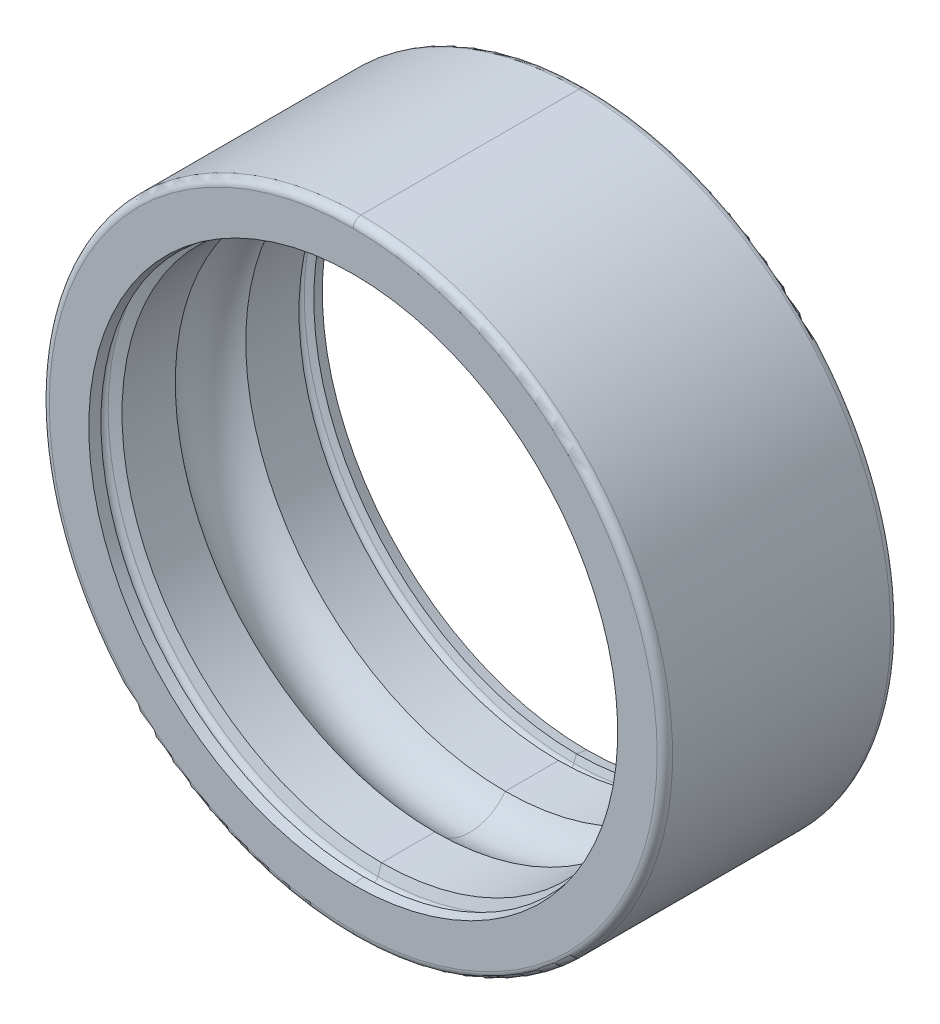
ISO-10303-21;
HEADER;
FILE_DESCRIPTION(('STEP AP214'),'2;1');
FILE_NAME('part.step','',(''),(''),'','','');
FILE_SCHEMA(('AUTOMOTIVE_DESIGN { 1 0 10303 214 1 1 1 1 }'));
ENDSEC;
DATA;
#1=APPLICATION_CONTEXT('core data for automotive mechanical design processes');
#2=APPLICATION_PROTOCOL_DEFINITION('international standard','automotive_design',2000,#1);
#3=PRODUCT_CONTEXT('',#1,'mechanical');
#4=PRODUCT('Part','Part','',(#3));
#5=PRODUCT_RELATED_PRODUCT_CATEGORY('part','',(#4));
#6=PRODUCT_DEFINITION_FORMATION('','',#4);
#7=PRODUCT_DEFINITION_CONTEXT('part definition',#1,'design');
#8=PRODUCT_DEFINITION('design','',#6,#7);
#9=PRODUCT_DEFINITION_SHAPE('','',#8);
#10=(LENGTH_UNIT() NAMED_UNIT(*) SI_UNIT(.MILLI.,.METRE.));
#11=(NAMED_UNIT(*) PLANE_ANGLE_UNIT() SI_UNIT($,.RADIAN.));
#12=(NAMED_UNIT(*) SI_UNIT($,.STERADIAN.) SOLID_ANGLE_UNIT());
#13=UNCERTAINTY_MEASURE_WITH_UNIT(LENGTH_MEASURE(1.E-05),#10,'distance_accuracy_value','');
#14=(GEOMETRIC_REPRESENTATION_CONTEXT(3) GLOBAL_UNCERTAINTY_ASSIGNED_CONTEXT((#13)) GLOBAL_UNIT_ASSIGNED_CONTEXT((#10,
#11,#12)) REPRESENTATION_CONTEXT('',''));
#15=CARTESIAN_POINT('',(0.,0.,0.));
#16=DIRECTION('',(0.,0.,1.));
#17=DIRECTION('',(1.,0.,0.));
#18=AXIS2_PLACEMENT_3D('',#15,#16,#17);
#19=CARTESIAN_POINT('',(0.,0.,-1.37117133981801));
#20=DIRECTION('',(0.,0.,1.));
#21=DIRECTION('',(0.,1.,0.));
#22=AXIS2_PLACEMENT_3D('',#19,#20,#21);
#23=CONICAL_SURFACE('',#22,3.35814874954358,1.22173047639603);
#24=DIRECTION('',(0.,-0.939692620785909,-0.342020143325669));
#25=VECTOR('',#24,1.);
#26=CARTESIAN_POINT('',(0.,3.46094982970443,-1.33375480658905));
#27=LINE('',#26,#25);
#28=CARTESIAN_POINT('',(0.,3.4609498297044,-1.33375480658897));
#29=VERTEX_POINT('',#28);
#30=CARTESIAN_POINT('',(0.,3.37134806634323,-1.36636718139026));
#31=VERTEX_POINT('',#30);
#32=EDGE_CURVE('E22',#29,#31,#27,.T.);
#33=ORIENTED_EDGE('',*,*,#32,.F.);
#34=CARTESIAN_POINT('',(0.,0.,-1.3337548065889));
#35=DIRECTION('',(0.,0.,1.));
#36=DIRECTION('',(0.,1.,0.));
#37=AXIS2_PLACEMENT_3D('',#34,#35,#36);
#38=CIRCLE('',#37,3.46094982970437);
#39=CARTESIAN_POINT('',(0.,-3.4609498297044,-1.33375480658897));
#40=VERTEX_POINT('',#39);
#41=EDGE_CURVE('E414',#29,#40,#38,.T.);
#42=ORIENTED_EDGE('',*,*,#41,.T.);
#43=DIRECTION('',(0.,0.939692620785909,-0.342020143325669));
#44=VECTOR('',#43,1.);
#45=CARTESIAN_POINT('',(0.,-3.46094982970443,-1.33375480658905));
#46=LINE('',#45,#44);
#47=CARTESIAN_POINT('',(0.,-3.37134806634323,-1.36636718139026));
#48=VERTEX_POINT('',#47);
#49=EDGE_CURVE('E418',#40,#48,#46,.T.);
#50=ORIENTED_EDGE('',*,*,#49,.T.);
#51=CARTESIAN_POINT('',(0.,0.,-1.36636718139037));
#52=DIRECTION('',(0.,0.,1.));
#53=DIRECTION('',(0.,1.,0.));
#54=AXIS2_PLACEMENT_3D('',#51,#52,#53);
#55=CIRCLE('',#54,3.37134806634301);
#56=EDGE_CURVE('E288',#31,#48,#55,.T.);
#57=ORIENTED_EDGE('',*,*,#56,.F.);
#58=EDGE_LOOP('',(#33,#42,#50,#57));
#59=FACE_BOUND('',#58,.T.);
#60=ADVANCED_FACE('F19',(#59),#23,.F.);
#61=CARTESIAN_POINT('',(0.,0.,1.64846));
#62=DIRECTION('',(0.,0.,-1.));
#63=DIRECTION('',(0.,-1.,0.));
#64=AXIS2_PLACEMENT_3D('',#61,#62,#63);
#65=CYLINDRICAL_SURFACE('',#64,4.0005);
#66=CARTESIAN_POINT('',(0.,0.,1.39954));
#67=DIRECTION('',(0.,0.,-1.));
#68=DIRECTION('',(0.,1.,0.));
#69=AXIS2_PLACEMENT_3D('',#66,#67,#68);
#70=CIRCLE('',#69,4.0005);
#71=CARTESIAN_POINT('',(0.,4.0005,1.39954));
#72=VERTEX_POINT('',#71);
#73=CARTESIAN_POINT('',(0.,-4.0005,1.39954));
#74=VERTEX_POINT('',#73);
#75=EDGE_CURVE('E167',#72,#74,#70,.T.);
#76=ORIENTED_EDGE('',*,*,#75,.T.);
#77=DIRECTION('',(0.,0.,-1.));
#78=VECTOR('',#77,1.);
#79=CARTESIAN_POINT('',(0.,-4.0005,1.39954));
#80=LINE('',#79,#78);
#81=CARTESIAN_POINT('',(0.,-4.0005,-1.39954));
#82=VERTEX_POINT('',#81);
#83=EDGE_CURVE('E12',#74,#82,#80,.T.);
#84=ORIENTED_EDGE('',*,*,#83,.T.);
#85=CARTESIAN_POINT('',(0.,0.,-1.39954));
#86=DIRECTION('',(0.,0.,1.));
#87=DIRECTION('',(0.,-1.,0.));
#88=AXIS2_PLACEMENT_3D('',#85,#86,#87);
#89=CIRCLE('',#88,4.0005);
#90=CARTESIAN_POINT('',(0.,4.0005,-1.39954));
#91=VERTEX_POINT('',#90);
#92=EDGE_CURVE('E39',#82,#91,#89,.T.);
#93=ORIENTED_EDGE('',*,*,#92,.T.);
#94=DIRECTION('',(0.,0.,-1.));
#95=VECTOR('',#94,1.);
#96=CARTESIAN_POINT('',(0.,4.0005,1.39954));
#97=LINE('',#96,#95);
#98=EDGE_CURVE('E28',#72,#91,#97,.T.);
#99=ORIENTED_EDGE('',*,*,#98,.F.);
#100=EDGE_LOOP('',(#76,#84,#93,#99));
#101=FACE_BOUND('',#100,.T.);
#102=ADVANCED_FACE('F405',(#101),#65,.T.);
#103=CARTESIAN_POINT('',(0.,0.,1.64846));
#104=DIRECTION('',(0.,0.,-1.));
#105=DIRECTION('',(0.,-1.,0.));
#106=AXIS2_PLACEMENT_3D('',#103,#104,#105);
#107=CYLINDRICAL_SURFACE('',#106,4.0005);
#108=CARTESIAN_POINT('',(0.,0.,-1.39954));
#109=DIRECTION('',(0.,0.,1.));
#110=DIRECTION('',(0.,1.,0.));
#111=AXIS2_PLACEMENT_3D('',#108,#109,#110);
#112=CIRCLE('',#111,4.0005);
#113=EDGE_CURVE('E181',#91,#82,#112,.T.);
#114=ORIENTED_EDGE('',*,*,#113,.T.);
#115=ORIENTED_EDGE('',*,*,#83,.F.);
#116=CARTESIAN_POINT('',(0.,0.,1.39954));
#117=DIRECTION('',(0.,0.,-1.));
#118=DIRECTION('',(0.,-1.,0.));
#119=AXIS2_PLACEMENT_3D('',#116,#117,#118);
#120=CIRCLE('',#119,4.0005);
#121=EDGE_CURVE('E164',#74,#72,#120,.T.);
#122=ORIENTED_EDGE('',*,*,#121,.T.);
#123=ORIENTED_EDGE('',*,*,#98,.T.);
#124=EDGE_LOOP('',(#114,#115,#122,#123));
#125=FACE_BOUND('',#124,.T.);
#126=ADVANCED_FACE('F410',(#125),#107,.T.);
#127=CARTESIAN_POINT('',(0.,0.,-1.39954));
#128=DIRECTION('',(0.,0.,-1.));
#129=DIRECTION('',(0.,-1.,0.));
#130=AXIS2_PLACEMENT_3D('',#127,#128,#129);
#131=TOROIDAL_SURFACE('',#130,3.90144,0.09906);
#132=CARTESIAN_POINT('',(0.,0.,-1.4986));
#133=DIRECTION('',(0.,0.,1.));
#134=DIRECTION('',(0.,1.,0.));
#135=AXIS2_PLACEMENT_3D('',#132,#133,#134);
#136=CIRCLE('',#135,3.90144);
#137=CARTESIAN_POINT('',(0.,3.90144,-1.4986));
#138=VERTEX_POINT('',#137);
#139=CARTESIAN_POINT('',(0.,-3.90144,-1.4986));
#140=VERTEX_POINT('',#139);
#141=EDGE_CURVE('E298',#138,#140,#136,.T.);
#142=ORIENTED_EDGE('',*,*,#141,.T.);
#143=CARTESIAN_POINT('',(0.,-3.90144,-1.39954));
#144=DIRECTION('',(1.,0.,0.));
#145=DIRECTION('',(0.,-1.,0.));
#146=AXIS2_PLACEMENT_3D('',#143,#144,#145);
#147=CIRCLE('',#146,0.09906);
#148=EDGE_CURVE('E187',#82,#140,#147,.T.);
#149=ORIENTED_EDGE('',*,*,#148,.F.);
#150=ORIENTED_EDGE('',*,*,#113,.F.);
#151=CARTESIAN_POINT('',(0.,3.90144,-1.39954));
#152=DIRECTION('',(-1.,0.,0.));
#153=DIRECTION('',(0.,1.,0.));
#154=AXIS2_PLACEMENT_3D('',#151,#152,#153);
#155=CIRCLE('',#154,0.09906);
#156=EDGE_CURVE('E190',#91,#138,#155,.T.);
#157=ORIENTED_EDGE('',*,*,#156,.T.);
#158=EDGE_LOOP('',(#142,#149,#150,#157));
#159=FACE_BOUND('',#158,.T.);
#160=ADVANCED_FACE('F567',(#159),#131,.T.);
#161=CARTESIAN_POINT('',(0.,0.,-1.39954));
#162=DIRECTION('',(0.,0.,-1.));
#163=DIRECTION('',(0.,-1.,0.));
#164=AXIS2_PLACEMENT_3D('',#161,#162,#163);
#165=TOROIDAL_SURFACE('',#164,3.90144,0.09906);
#166=ORIENTED_EDGE('',*,*,#92,.F.);
#167=ORIENTED_EDGE('',*,*,#148,.T.);
#168=CARTESIAN_POINT('',(0.,0.,-1.4986));
#169=DIRECTION('',(0.,0.,1.));
#170=DIRECTION('',(0.,-1.,0.));
#171=AXIS2_PLACEMENT_3D('',#168,#169,#170);
#172=CIRCLE('',#171,3.90144);
#173=EDGE_CURVE('E291',#140,#138,#172,.T.);
#174=ORIENTED_EDGE('',*,*,#173,.T.);
#175=ORIENTED_EDGE('',*,*,#156,.F.);
#176=EDGE_LOOP('',(#166,#167,#174,#175));
#177=FACE_BOUND('',#176,.T.);
#178=ADVANCED_FACE('F563',(#177),#165,.T.);
#179=CARTESIAN_POINT('',(0.,0.,-1.4986));
#180=DIRECTION('',(0.,0.,-1.));
#181=DIRECTION('',(0.,-1.,0.));
#182=AXIS2_PLACEMENT_3D('',#179,#180,#181);
#183=PLANE('',#182);
#184=CARTESIAN_POINT('',(0.,0.,-1.4986000000001));
#185=DIRECTION('',(0.,0.,-1.));
#186=DIRECTION('',(0.,1.,0.));
#187=AXIS2_PLACEMENT_3D('',#184,#185,#186);
#188=CIRCLE('',#187,3.39466427999951);
#189=CARTESIAN_POINT('',(0.,3.39466427999967,-1.49860000000006));
#190=VERTEX_POINT('',#189);
#191=CARTESIAN_POINT('',(0.,-3.39466427999967,-1.49860000000006));
#192=VERTEX_POINT('',#191);
#193=EDGE_CURVE('E301',#190,#192,#188,.T.);
#194=ORIENTED_EDGE('',*,*,#193,.F.);
#195=CARTESIAN_POINT('',(0.,0.,-1.4986000000001));
#196=DIRECTION('',(0.,0.,-1.));
#197=DIRECTION('',(0.,-1.,0.));
#198=AXIS2_PLACEMENT_3D('',#195,#196,#197);
#199=CIRCLE('',#198,3.39466427999951);
#200=EDGE_CURVE('E292',#192,#190,#199,.T.);
#201=ORIENTED_EDGE('',*,*,#200,.F.);
#202=EDGE_LOOP('',(#194,#201));
#203=FACE_BOUND('',#202,.T.);
#204=ORIENTED_EDGE('',*,*,#141,.F.);
#205=ORIENTED_EDGE('',*,*,#173,.F.);
#206=EDGE_LOOP('',(#204,#205));
#207=FACE_BOUND('',#206,.T.);
#208=ADVANCED_FACE('F560',(#203,#207),#183,.T.);
#209=CARTESIAN_POINT('',(0.,0.,-1.35253415851541));
#210=DIRECTION('',(0.,0.,-1.));
#211=DIRECTION('',(0.,-1.,0.));
#212=AXIS2_PLACEMENT_3D('',#209,#210,#211);
#213=CONICAL_SURFACE('',#212,3.36890893118588,0.174532925199433);
#214=ORIENTED_EDGE('',*,*,#56,.T.);
#215=DIRECTION('',(0.,0.173648177666929,0.984807753012208));
#216=VECTOR('',#215,1.);
#217=CARTESIAN_POINT('',(0.,-3.39466427999951,-1.49860000000009));
#218=LINE('',#217,#216);
#219=EDGE_CURVE('E305',#192,#48,#218,.T.);
#220=ORIENTED_EDGE('',*,*,#219,.F.);
#221=ORIENTED_EDGE('',*,*,#200,.T.);
#222=DIRECTION('',(0.,-0.173648177666929,0.984807753012208));
#223=VECTOR('',#222,1.);
#224=CARTESIAN_POINT('',(0.,3.39466427999951,-1.49860000000009));
#225=LINE('',#224,#223);
#226=EDGE_CURVE('E440',#190,#31,#225,.T.);
#227=ORIENTED_EDGE('',*,*,#226,.T.);
#228=EDGE_LOOP('',(#214,#220,#221,#227));
#229=FACE_BOUND('',#228,.T.);
#230=ADVANCED_FACE('F556',(#229),#213,.F.);
#231=CARTESIAN_POINT('',(0.,0.,-1.35253415851541));
#232=DIRECTION('',(0.,0.,-1.));
#233=DIRECTION('',(0.,-1.,0.));
#234=AXIS2_PLACEMENT_3D('',#231,#232,#233);
#235=CONICAL_SURFACE('',#234,3.36890893118588,0.174532925199433);
#236=ORIENTED_EDGE('',*,*,#193,.T.);
#237=ORIENTED_EDGE('',*,*,#219,.T.);
#238=CARTESIAN_POINT('',(0.,0.,-1.36636718139037));
#239=DIRECTION('',(0.,0.,1.));
#240=DIRECTION('',(0.,-1.,0.));
#241=AXIS2_PLACEMENT_3D('',#238,#239,#240);
#242=CIRCLE('',#241,3.37134806634301);
#243=EDGE_CURVE('E419',#48,#31,#242,.T.);
#244=ORIENTED_EDGE('',*,*,#243,.T.);
#245=ORIENTED_EDGE('',*,*,#226,.F.);
#246=EDGE_LOOP('',(#236,#237,#244,#245));
#247=FACE_BOUND('',#246,.T.);
#248=ADVANCED_FACE('F553',(#247),#235,.F.);
#249=CARTESIAN_POINT('',(0.,0.,-1.37117133981801));
#250=DIRECTION('',(0.,0.,1.));
#251=DIRECTION('',(0.,1.,0.));
#252=AXIS2_PLACEMENT_3D('',#249,#250,#251);
#253=CONICAL_SURFACE('',#252,3.35814874954358,1.22173047639603);
#254=ORIENTED_EDGE('',*,*,#49,.F.);
#255=CARTESIAN_POINT('',(0.,0.,-1.3337548065889));
#256=DIRECTION('',(0.,0.,1.));
#257=DIRECTION('',(0.,-1.,0.));
#258=AXIS2_PLACEMENT_3D('',#255,#256,#257);
#259=CIRCLE('',#258,3.46094982970437);
#260=EDGE_CURVE('E206',#40,#29,#259,.T.);
#261=ORIENTED_EDGE('',*,*,#260,.T.);
#262=ORIENTED_EDGE('',*,*,#32,.T.);
#263=ORIENTED_EDGE('',*,*,#243,.F.);
#264=EDGE_LOOP('',(#254,#261,#262,#263));
#265=FACE_BOUND('',#264,.T.);
#266=ADVANCED_FACE('F422',(#265),#253,.F.);
#267=CARTESIAN_POINT('',(0.,0.,-1.25857));
#268=DIRECTION('',(0.,0.,-1.));
#269=DIRECTION('',(0.,-1.,0.));
#270=AXIS2_PLACEMENT_3D('',#267,#268,#269);
#271=TOROIDAL_SURFACE('',#270,3.43358479803638,0.08001);
#272=ORIENTED_EDGE('',*,*,#260,.F.);
#273=CARTESIAN_POINT('',(0.,-3.43358479803638,-1.25857));
#274=DIRECTION('',(-1.,0.,0.));
#275=DIRECTION('',(0.,-0.342020143331979,-0.939692620783611));
#276=AXIS2_PLACEMENT_3D('',#273,#274,#275);
#277=CIRCLE('',#276,0.08001);
#278=CARTESIAN_POINT('',(0.,-3.51359479803638,-1.25857));
#279=VERTEX_POINT('',#278);
#280=EDGE_CURVE('E207',#40,#279,#277,.T.);
#281=ORIENTED_EDGE('',*,*,#280,.T.);
#282=CARTESIAN_POINT('',(0.,-3.43358479803638,-1.25857));
#283=DIRECTION('',(-1.,0.,0.));
#284=DIRECTION('',(0.,-1.,0.));
#285=AXIS2_PLACEMENT_3D('',#282,#283,#284);
#286=CIRCLE('',#285,0.08001);
#287=CARTESIAN_POINT('',(0.,-3.46094982970447,-1.18338519341083));
#288=VERTEX_POINT('',#287);
#289=EDGE_CURVE('E203',#279,#288,#286,.T.);
#290=ORIENTED_EDGE('',*,*,#289,.T.);
#291=CARTESIAN_POINT('',(0.,0.,-1.1833851934111));
#292=DIRECTION('',(0.,0.,-1.));
#293=DIRECTION('',(0.,1.,0.));
#294=AXIS2_PLACEMENT_3D('',#291,#292,#293);
#295=CIRCLE('',#294,3.46094982970437);
#296=CARTESIAN_POINT('',(0.,3.46094982970447,-1.18338519341083));
#297=VERTEX_POINT('',#296);
#298=EDGE_CURVE('E215',#297,#288,#295,.T.);
#299=ORIENTED_EDGE('',*,*,#298,.F.);
#300=CARTESIAN_POINT('',(0.,3.43358479803638,-1.25857));
#301=DIRECTION('',(1.,0.,0.));
#302=DIRECTION('',(0.,1.,0.));
#303=AXIS2_PLACEMENT_3D('',#300,#301,#302);
#304=CIRCLE('',#303,0.08001);
#305=CARTESIAN_POINT('',(0.,3.51359479803638,-1.25857));
#306=VERTEX_POINT('',#305);
#307=EDGE_CURVE('E214',#306,#297,#304,.T.);
#308=ORIENTED_EDGE('',*,*,#307,.F.);
#309=CARTESIAN_POINT('',(0.,3.43358479803638,-1.25857));
#310=DIRECTION('',(1.,0.,0.));
#311=DIRECTION('',(0.,0.342020143331979,-0.939692620783611));
#312=AXIS2_PLACEMENT_3D('',#309,#310,#311);
#313=CIRCLE('',#312,0.08001);
#314=EDGE_CURVE('E216',#29,#306,#313,.T.);
#315=ORIENTED_EDGE('',*,*,#314,.F.);
#316=EDGE_LOOP('',(#272,#281,#290,#299,#308,#315));
#317=FACE_BOUND('',#316,.T.);
#318=ADVANCED_FACE('F427',(#317),#271,.F.);
#319=CARTESIAN_POINT('',(0.,0.,-1.25857));
#320=DIRECTION('',(0.,0.,-1.));
#321=DIRECTION('',(0.,-1.,0.));
#322=AXIS2_PLACEMENT_3D('',#319,#320,#321);
#323=TOROIDAL_SURFACE('',#322,3.43358479803638,0.08001);
#324=CARTESIAN_POINT('',(0.,0.,-1.1833851934111));
#325=DIRECTION('',(0.,0.,-1.));
#326=DIRECTION('',(0.,-1.,0.));
#327=AXIS2_PLACEMENT_3D('',#324,#325,#326);
#328=CIRCLE('',#327,3.46094982970437);
#329=EDGE_CURVE('E210',#288,#297,#328,.T.);
#330=ORIENTED_EDGE('',*,*,#329,.F.);
#331=ORIENTED_EDGE('',*,*,#289,.F.);
#332=ORIENTED_EDGE('',*,*,#280,.F.);
#333=ORIENTED_EDGE('',*,*,#41,.F.);
#334=ORIENTED_EDGE('',*,*,#314,.T.);
#335=ORIENTED_EDGE('',*,*,#307,.T.);
#336=EDGE_LOOP('',(#330,#331,#332,#333,#334,#335));
#337=FACE_BOUND('',#336,.T.);
#338=ADVANCED_FACE('F431',(#337),#323,.F.);
#339=CARTESIAN_POINT('',(0.,0.,-1.13118340978411));
#340=DIRECTION('',(0.,0.,-1.));
#341=DIRECTION('',(0.,-1.,0.));
#342=AXIS2_PLACEMENT_3D('',#339,#340,#341);
#343=CONICAL_SURFACE('',#342,3.31752660793567,1.22173047639603);
#344=CARTESIAN_POINT('',(0.,0.,-1.13598756821175));
#345=DIRECTION('',(0.,0.,-1.));
#346=DIRECTION('',(0.,-1.,0.));
#347=AXIS2_PLACEMENT_3D('',#344,#345,#346);
#348=CIRCLE('',#347,3.3307259247351);
#349=CARTESIAN_POINT('',(0.,-3.33072592473504,-1.13598756821192));
#350=VERTEX_POINT('',#349);
#351=CARTESIAN_POINT('',(0.,3.33072592473504,-1.13598756821192));
#352=VERTEX_POINT('',#351);
#353=EDGE_CURVE('E434',#350,#352,#348,.T.);
#354=ORIENTED_EDGE('',*,*,#353,.F.);
#355=DIRECTION('',(0.,0.939692620785908,0.342020143325669));
#356=VECTOR('',#355,1.);
#357=CARTESIAN_POINT('',(0.,-3.46094982970457,-1.18338519341055));
#358=LINE('',#357,#356);
#359=EDGE_CURVE('E231',#288,#350,#358,.T.);
#360=ORIENTED_EDGE('',*,*,#359,.F.);
#361=ORIENTED_EDGE('',*,*,#329,.T.);
#362=DIRECTION('',(0.,-0.939692620785908,0.342020143325669));
#363=VECTOR('',#362,1.);
#364=CARTESIAN_POINT('',(0.,3.46094982970457,-1.18338519341055));
#365=LINE('',#364,#363);
#366=EDGE_CURVE('E227',#297,#352,#365,.T.);
#367=ORIENTED_EDGE('',*,*,#366,.T.);
#368=EDGE_LOOP('',(#354,#360,#361,#367));
#369=FACE_BOUND('',#368,.T.);
#370=ADVANCED_FACE('F454',(#369),#343,.F.);
#371=CARTESIAN_POINT('',(0.,0.,-1.13118340978411));
#372=DIRECTION('',(0.,0.,-1.));
#373=DIRECTION('',(0.,-1.,0.));
#374=AXIS2_PLACEMENT_3D('',#371,#372,#373);
#375=CONICAL_SURFACE('',#374,3.31752660793567,1.22173047639603);
#376=ORIENTED_EDGE('',*,*,#298,.T.);
#377=ORIENTED_EDGE('',*,*,#359,.T.);
#378=CARTESIAN_POINT('',(0.,0.,-1.13598756821175));
#379=DIRECTION('',(0.,0.,-1.));
#380=DIRECTION('',(0.,1.,0.));
#381=AXIS2_PLACEMENT_3D('',#378,#379,#380);
#382=CIRCLE('',#381,3.3307259247351);
#383=EDGE_CURVE('E236',#352,#350,#382,.T.);
#384=ORIENTED_EDGE('',*,*,#383,.F.);
#385=ORIENTED_EDGE('',*,*,#366,.F.);
#386=EDGE_LOOP('',(#376,#377,#384,#385));
#387=FACE_BOUND('',#386,.T.);
#388=ADVANCED_FACE('F458',(#387),#375,.F.);
#389=CARTESIAN_POINT('',(0.,0.,0.07493));
#390=DIRECTION('',(0.,0.,-1.));
#391=DIRECTION('',(0.,-1.,0.));
#392=AXIS2_PLACEMENT_3D('',#389,#390,#391);
#393=CYLINDRICAL_SURFACE('',#392,3.33072592473498);
#394=DIRECTION('',(0.,0.,-1.));
#395=VECTOR('',#394,1.);
#396=CARTESIAN_POINT('',(0.,-3.33072592473498,1.13598756821209));
#397=LINE('',#396,#395);
#398=CARTESIAN_POINT('',(0.,-3.33072592473504,1.13598756821192));
#399=VERTEX_POINT('',#398);
#400=CARTESIAN_POINT('',(0.,-3.33072592473505,0.452268362177334));
#401=VERTEX_POINT('',#400);
#402=EDGE_CURVE('E233',#399,#401,#397,.T.);
#403=ORIENTED_EDGE('',*,*,#402,.F.);
#404=CARTESIAN_POINT('',(0.,0.,1.13598756821175));
#405=DIRECTION('',(0.,0.,1.));
#406=DIRECTION('',(0.,-1.,0.));
#407=AXIS2_PLACEMENT_3D('',#404,#405,#406);
#408=CIRCLE('',#407,3.3307259247351);
#409=CARTESIAN_POINT('',(0.,3.33072592473504,1.13598756821192));
#410=VERTEX_POINT('',#409);
#411=EDGE_CURVE('E247',#399,#410,#408,.T.);
#412=ORIENTED_EDGE('',*,*,#411,.T.);
#413=DIRECTION('',(0.,0.,1.));
#414=VECTOR('',#413,1.);
#415=CARTESIAN_POINT('',(0.,3.33072592473498,0.45226836217724));
#416=LINE('',#415,#414);
#417=CARTESIAN_POINT('',(0.,3.33072592473505,0.452268362177334));
#418=VERTEX_POINT('',#417);
#419=EDGE_CURVE('E509',#418,#410,#416,.T.);
#420=ORIENTED_EDGE('',*,*,#419,.F.);
#421=CARTESIAN_POINT('',(0.,0.,0.452268362177428));
#422=DIRECTION('',(0.,0.,-1.));
#423=DIRECTION('',(0.,1.,0.));
#424=AXIS2_PLACEMENT_3D('',#421,#422,#423);
#425=CIRCLE('',#424,3.33072592473512);
#426=EDGE_CURVE('E232',#418,#401,#425,.T.);
#427=ORIENTED_EDGE('',*,*,#426,.T.);
#428=EDGE_LOOP('',(#403,#412,#420,#427));
#429=FACE_BOUND('',#428,.T.);
#430=ADVANCED_FACE('F518',(#429),#393,.F.);
#431=CARTESIAN_POINT('',(0.,0.,0.));
#432=DIRECTION('',(0.,0.,-1.));
#433=DIRECTION('',(0.,-1.,0.));
#434=AXIS2_PLACEMENT_3D('',#431,#432,#433);
#435=TOROIDAL_SURFACE('',#434,3.000375,0.56007);
#436=CARTESIAN_POINT('',(0.,-3.000375,0.));
#437=DIRECTION('',(1.,0.,0.));
#438=DIRECTION('',(0.,-1.,0.));
#439=AXIS2_PLACEMENT_3D('',#436,#437,#438);
#440=CIRCLE('',#439,0.56007);
#441=CARTESIAN_POINT('',(0.,-3.560445,0.));
#442=VERTEX_POINT('',#441);
#443=CARTESIAN_POINT('',(0.,-3.33072592473505,-0.452268362177334));
#444=VERTEX_POINT('',#443);
#445=EDGE_CURVE('E506',#442,#444,#440,.T.);
#446=ORIENTED_EDGE('',*,*,#445,.F.);
#447=CARTESIAN_POINT('',(0.,-3.000375,0.));
#448=DIRECTION('',(1.,0.,0.));
#449=DIRECTION('',(0.,-0.589838635768952,0.807521135174939));
#450=AXIS2_PLACEMENT_3D('',#447,#448,#449);
#451=CIRCLE('',#450,0.56007);
#452=EDGE_CURVE('E494',#401,#442,#451,.T.);
#453=ORIENTED_EDGE('',*,*,#452,.F.);
#454=ORIENTED_EDGE('',*,*,#426,.F.);
#455=CARTESIAN_POINT('',(0.,3.000375,0.));
#456=DIRECTION('',(-1.,0.,0.));
#457=DIRECTION('',(0.,0.589838635768952,0.807521135174938));
#458=AXIS2_PLACEMENT_3D('',#455,#456,#457);
#459=CIRCLE('',#458,0.56007);
#460=CARTESIAN_POINT('',(0.,3.560445,0.));
#461=VERTEX_POINT('',#460);
#462=EDGE_CURVE('E492',#418,#461,#459,.T.);
#463=ORIENTED_EDGE('',*,*,#462,.T.);
#464=CARTESIAN_POINT('',(0.,3.000375,0.));
#465=DIRECTION('',(-1.,0.,0.));
#466=DIRECTION('',(0.,1.,0.));
#467=AXIS2_PLACEMENT_3D('',#464,#465,#466);
#468=CIRCLE('',#467,0.56007);
#469=CARTESIAN_POINT('',(0.,3.33072592473505,-0.452268362177334));
#470=VERTEX_POINT('',#469);
#471=EDGE_CURVE('E471',#461,#470,#468,.T.);
#472=ORIENTED_EDGE('',*,*,#471,.T.);
#473=CARTESIAN_POINT('',(0.,0.,-0.452268362177428));
#474=DIRECTION('',(0.,0.,1.));
#475=DIRECTION('',(0.,-1.,0.));
#476=AXIS2_PLACEMENT_3D('',#473,#474,#475);
#477=CIRCLE('',#476,3.33072592473512);
#478=EDGE_CURVE('E239',#444,#470,#477,.T.);
#479=ORIENTED_EDGE('',*,*,#478,.F.);
#480=EDGE_LOOP('',(#446,#453,#454,#463,#472,#479));
#481=FACE_BOUND('',#480,.T.);
#482=ADVANCED_FACE('F523',(#481),#435,.F.);
#483=CARTESIAN_POINT('',(0.,0.,0.07493));
#484=DIRECTION('',(0.,0.,-1.));
#485=DIRECTION('',(0.,-1.,0.));
#486=AXIS2_PLACEMENT_3D('',#483,#484,#485);
#487=CYLINDRICAL_SURFACE('',#486,3.33072592473498);
#488=DIRECTION('',(0.,0.,1.));
#489=VECTOR('',#488,1.);
#490=CARTESIAN_POINT('',(0.,3.33072592473498,-1.13598756821209));
#491=LINE('',#490,#489);
#492=EDGE_CURVE('E465',#352,#470,#491,.T.);
#493=ORIENTED_EDGE('',*,*,#492,.F.);
#494=ORIENTED_EDGE('',*,*,#383,.T.);
#495=DIRECTION('',(0.,0.,-1.));
#496=VECTOR('',#495,1.);
#497=CARTESIAN_POINT('',(0.,-3.33072592473498,-0.45226836217724));
#498=LINE('',#497,#496);
#499=EDGE_CURVE('E474',#444,#350,#498,.T.);
#500=ORIENTED_EDGE('',*,*,#499,.F.);
#501=ORIENTED_EDGE('',*,*,#478,.T.);
#502=EDGE_LOOP('',(#493,#494,#500,#501));
#503=FACE_BOUND('',#502,.T.);
#504=ADVANCED_FACE('F467',(#503),#487,.F.);
#505=CARTESIAN_POINT('',(0.,0.,0.07493));
#506=DIRECTION('',(0.,0.,-1.));
#507=DIRECTION('',(0.,-1.,0.));
#508=AXIS2_PLACEMENT_3D('',#505,#506,#507);
#509=CYLINDRICAL_SURFACE('',#508,3.33072592473498);
#510=ORIENTED_EDGE('',*,*,#499,.T.);
#511=ORIENTED_EDGE('',*,*,#353,.T.);
#512=ORIENTED_EDGE('',*,*,#492,.T.);
#513=CARTESIAN_POINT('',(0.,0.,-0.452268362177428));
#514=DIRECTION('',(0.,0.,1.));
#515=DIRECTION('',(0.,1.,0.));
#516=AXIS2_PLACEMENT_3D('',#513,#514,#515);
#517=CIRCLE('',#516,3.33072592473512);
#518=EDGE_CURVE('E490',#470,#444,#517,.T.);
#519=ORIENTED_EDGE('',*,*,#518,.T.);
#520=EDGE_LOOP('',(#510,#511,#512,#519));
#521=FACE_BOUND('',#520,.T.);
#522=ADVANCED_FACE('F473',(#521),#509,.F.);
#523=CARTESIAN_POINT('',(0.,0.,0.));
#524=DIRECTION('',(0.,0.,-1.));
#525=DIRECTION('',(0.,-1.,0.));
#526=AXIS2_PLACEMENT_3D('',#523,#524,#525);
#527=TOROIDAL_SURFACE('',#526,3.000375,0.56007);
#528=ORIENTED_EDGE('',*,*,#471,.F.);
#529=ORIENTED_EDGE('',*,*,#462,.F.);
#530=CARTESIAN_POINT('',(0.,0.,0.452268362177428));
#531=DIRECTION('',(0.,0.,-1.));
#532=DIRECTION('',(0.,-1.,0.));
#533=AXIS2_PLACEMENT_3D('',#530,#531,#532);
#534=CIRCLE('',#533,3.33072592473512);
#535=EDGE_CURVE('E487',#401,#418,#534,.T.);
#536=ORIENTED_EDGE('',*,*,#535,.F.);
#537=ORIENTED_EDGE('',*,*,#452,.T.);
#538=ORIENTED_EDGE('',*,*,#445,.T.);
#539=ORIENTED_EDGE('',*,*,#518,.F.);
#540=EDGE_LOOP('',(#528,#529,#536,#537,#538,#539));
#541=FACE_BOUND('',#540,.T.);
#542=ADVANCED_FACE('F526',(#541),#527,.F.);
#543=CARTESIAN_POINT('',(0.,0.,0.07493));
#544=DIRECTION('',(0.,0.,-1.));
#545=DIRECTION('',(0.,-1.,0.));
#546=AXIS2_PLACEMENT_3D('',#543,#544,#545);
#547=CYLINDRICAL_SURFACE('',#546,3.33072592473498);
#548=ORIENTED_EDGE('',*,*,#419,.T.);
#549=CARTESIAN_POINT('',(0.,0.,1.13598756821175));
#550=DIRECTION('',(0.,0.,1.));
#551=DIRECTION('',(0.,1.,0.));
#552=AXIS2_PLACEMENT_3D('',#549,#550,#551);
#553=CIRCLE('',#552,3.3307259247351);
#554=EDGE_CURVE('E251',#410,#399,#553,.T.);
#555=ORIENTED_EDGE('',*,*,#554,.T.);
#556=ORIENTED_EDGE('',*,*,#402,.T.);
#557=ORIENTED_EDGE('',*,*,#535,.T.);
#558=EDGE_LOOP('',(#548,#555,#556,#557));
#559=FACE_BOUND('',#558,.T.);
#560=ADVANCED_FACE('F515',(#559),#547,.F.);
#561=CARTESIAN_POINT('',(0.,0.,1.13118340978411));
#562=DIRECTION('',(0.,0.,1.));
#563=DIRECTION('',(0.,1.,0.));
#564=AXIS2_PLACEMENT_3D('',#561,#562,#563);
#565=CONICAL_SURFACE('',#564,3.31752660793567,1.22173047639603);
#566=CARTESIAN_POINT('',(0.,0.,1.1833851934111));
#567=DIRECTION('',(0.,0.,1.));
#568=DIRECTION('',(0.,1.,0.));
#569=AXIS2_PLACEMENT_3D('',#566,#567,#568);
#570=CIRCLE('',#569,3.46094982970437);
#571=CARTESIAN_POINT('',(0.,3.46094982970447,1.18338519341083));
#572=VERTEX_POINT('',#571);
#573=CARTESIAN_POINT('',(0.,-3.46094982970447,1.18338519341083));
#574=VERTEX_POINT('',#573);
#575=EDGE_CURVE('E277',#572,#574,#570,.T.);
#576=ORIENTED_EDGE('',*,*,#575,.T.);
#577=DIRECTION('',(0.,0.939692620785908,-0.342020143325669));
#578=VECTOR('',#577,1.);
#579=CARTESIAN_POINT('',(0.,-3.46094982970457,1.18338519341055));
#580=LINE('',#579,#578);
#581=EDGE_CURVE('E252',#574,#399,#580,.T.);
#582=ORIENTED_EDGE('',*,*,#581,.T.);
#583=ORIENTED_EDGE('',*,*,#554,.F.);
#584=DIRECTION('',(0.,-0.939692620785908,-0.342020143325669));
#585=VECTOR('',#584,1.);
#586=CARTESIAN_POINT('',(0.,3.46094982970457,1.18338519341055));
#587=LINE('',#586,#585);
#588=EDGE_CURVE('E255',#572,#410,#587,.T.);
#589=ORIENTED_EDGE('',*,*,#588,.F.);
#590=EDGE_LOOP('',(#576,#582,#583,#589));
#591=FACE_BOUND('',#590,.T.);
#592=ADVANCED_FACE('F368',(#591),#565,.F.);
#593=CARTESIAN_POINT('',(0.,0.,1.13118340978411));
#594=DIRECTION('',(0.,0.,1.));
#595=DIRECTION('',(0.,1.,0.));
#596=AXIS2_PLACEMENT_3D('',#593,#594,#595);
#597=CONICAL_SURFACE('',#596,3.31752660793567,1.22173047639603);
#598=ORIENTED_EDGE('',*,*,#411,.F.);
#599=ORIENTED_EDGE('',*,*,#581,.F.);
#600=CARTESIAN_POINT('',(0.,0.,1.1833851934111));
#601=DIRECTION('',(0.,0.,1.));
#602=DIRECTION('',(0.,-1.,0.));
#603=AXIS2_PLACEMENT_3D('',#600,#601,#602);
#604=CIRCLE('',#603,3.46094982970437);
#605=EDGE_CURVE('E259',#574,#572,#604,.T.);
#606=ORIENTED_EDGE('',*,*,#605,.T.);
#607=ORIENTED_EDGE('',*,*,#588,.T.);
#608=EDGE_LOOP('',(#598,#599,#606,#607));
#609=FACE_BOUND('',#608,.T.);
#610=ADVANCED_FACE('F373',(#609),#597,.F.);
#611=CARTESIAN_POINT('',(0.,0.,1.25857));
#612=DIRECTION('',(0.,0.,-1.));
#613=DIRECTION('',(0.,-1.,0.));
#614=AXIS2_PLACEMENT_3D('',#611,#612,#613);
#615=TOROIDAL_SURFACE('',#614,3.43358479803638,0.08001);
#616=ORIENTED_EDGE('',*,*,#605,.F.);
#617=CARTESIAN_POINT('',(0.,-3.43358479803638,1.25857));
#618=DIRECTION('',(1.,0.,0.));
#619=DIRECTION('',(0.,-1.,0.));
#620=AXIS2_PLACEMENT_3D('',#617,#618,#619);
#621=CIRCLE('',#620,0.08001);
#622=CARTESIAN_POINT('',(0.,-3.51359479803638,1.25857));
#623=VERTEX_POINT('',#622);
#624=EDGE_CURVE('E273',#623,#574,#621,.T.);
#625=ORIENTED_EDGE('',*,*,#624,.F.);
#626=CARTESIAN_POINT('',(0.,-3.43358479803638,1.25857));
#627=DIRECTION('',(1.,0.,0.));
#628=DIRECTION('',(0.,-0.342020143331979,0.939692620783611));
#629=AXIS2_PLACEMENT_3D('',#626,#627,#628);
#630=CIRCLE('',#629,0.08001);
#631=CARTESIAN_POINT('',(0.,-3.4609498297044,1.33375480658897));
#632=VERTEX_POINT('',#631);
#633=EDGE_CURVE('E272',#632,#623,#630,.T.);
#634=ORIENTED_EDGE('',*,*,#633,.F.);
#635=CARTESIAN_POINT('',(0.,0.,1.3337548065889));
#636=DIRECTION('',(0.,0.,-1.));
#637=DIRECTION('',(0.,1.,0.));
#638=AXIS2_PLACEMENT_3D('',#635,#636,#637);
#639=CIRCLE('',#638,3.46094982970437);
#640=CARTESIAN_POINT('',(0.,3.4609498297044,1.33375480658897));
#641=VERTEX_POINT('',#640);
#642=EDGE_CURVE('E334',#641,#632,#639,.T.);
#643=ORIENTED_EDGE('',*,*,#642,.F.);
#644=CARTESIAN_POINT('',(0.,3.43358479803638,1.25857));
#645=DIRECTION('',(-1.,0.,0.));
#646=DIRECTION('',(0.,0.342020143331979,0.939692620783611));
#647=AXIS2_PLACEMENT_3D('',#644,#645,#646);
#648=CIRCLE('',#647,0.08001);
#649=CARTESIAN_POINT('',(0.,3.51359479803638,1.25857));
#650=VERTEX_POINT('',#649);
#651=EDGE_CURVE('E344',#641,#650,#648,.T.);
#652=ORIENTED_EDGE('',*,*,#651,.T.);
#653=CARTESIAN_POINT('',(0.,3.43358479803638,1.25857));
#654=DIRECTION('',(-1.,0.,0.));
#655=DIRECTION('',(0.,1.,0.));
#656=AXIS2_PLACEMENT_3D('',#653,#654,#655);
#657=CIRCLE('',#656,0.08001);
#658=EDGE_CURVE('E359',#650,#572,#657,.T.);
#659=ORIENTED_EDGE('',*,*,#658,.T.);
#660=EDGE_LOOP('',(#616,#625,#634,#643,#652,#659));
#661=FACE_BOUND('',#660,.T.);
#662=ADVANCED_FACE('F374',(#661),#615,.F.);
#663=CARTESIAN_POINT('',(0.,0.,1.25857));
#664=DIRECTION('',(0.,0.,-1.));
#665=DIRECTION('',(0.,-1.,0.));
#666=AXIS2_PLACEMENT_3D('',#663,#664,#665);
#667=TOROIDAL_SURFACE('',#666,3.43358479803638,0.08001);
#668=CARTESIAN_POINT('',(0.,0.,1.3337548065889));
#669=DIRECTION('',(0.,0.,-1.));
#670=DIRECTION('',(0.,-1.,0.));
#671=AXIS2_PLACEMENT_3D('',#668,#669,#670);
#672=CIRCLE('',#671,3.46094982970437);
#673=EDGE_CURVE('E340',#632,#641,#672,.T.);
#674=ORIENTED_EDGE('',*,*,#673,.F.);
#675=ORIENTED_EDGE('',*,*,#633,.T.);
#676=ORIENTED_EDGE('',*,*,#624,.T.);
#677=ORIENTED_EDGE('',*,*,#575,.F.);
#678=ORIENTED_EDGE('',*,*,#658,.F.);
#679=ORIENTED_EDGE('',*,*,#651,.F.);
#680=EDGE_LOOP('',(#674,#675,#676,#677,#678,#679));
#681=FACE_BOUND('',#680,.T.);
#682=ADVANCED_FACE('F377',(#681),#667,.F.);
#683=CARTESIAN_POINT('',(0.,0.,1.35253415851542));
#684=DIRECTION('',(0.,0.,1.));
#685=DIRECTION('',(0.,1.,0.));
#686=AXIS2_PLACEMENT_3D('',#683,#684,#685);
#687=CONICAL_SURFACE('',#686,3.36890893118588,0.174532925199433);
#688=DIRECTION('',(0.,0.173648177666929,0.984807753012208));
#689=VECTOR('',#688,1.);
#690=CARTESIAN_POINT('',(0.,3.37134806634345,1.36636718139015));
#691=LINE('',#690,#689);
#692=CARTESIAN_POINT('',(0.,3.37134806634323,1.36636718139026));
#693=VERTEX_POINT('',#692);
#694=CARTESIAN_POINT('',(0.,3.39466427999967,1.49860000000006));
#695=VERTEX_POINT('',#694);
#696=EDGE_CURVE('E327',#693,#695,#691,.T.);
#697=ORIENTED_EDGE('',*,*,#696,.T.);
#698=CARTESIAN_POINT('',(0.,0.,1.4986000000001));
#699=DIRECTION('',(0.,0.,1.));
#700=DIRECTION('',(0.,1.,0.));
#701=AXIS2_PLACEMENT_3D('',#698,#699,#700);
#702=CIRCLE('',#701,3.39466427999951);
#703=CARTESIAN_POINT('',(0.,-3.39466427999967,1.49860000000006));
#704=VERTEX_POINT('',#703);
#705=EDGE_CURVE('E321',#695,#704,#702,.T.);
#706=ORIENTED_EDGE('',*,*,#705,.T.);
#707=DIRECTION('',(0.,-0.173648177666929,0.984807753012208));
#708=VECTOR('',#707,1.);
#709=CARTESIAN_POINT('',(0.,-3.37134806634345,1.36636718139015));
#710=LINE('',#709,#708);
#711=CARTESIAN_POINT('',(0.,-3.37134806634323,1.36636718139026));
#712=VERTEX_POINT('',#711);
#713=EDGE_CURVE('E355',#712,#704,#710,.T.);
#714=ORIENTED_EDGE('',*,*,#713,.F.);
#715=CARTESIAN_POINT('',(0.,0.,1.36636718139015));
#716=DIRECTION('',(0.,0.,1.));
#717=DIRECTION('',(0.,1.,0.));
#718=AXIS2_PLACEMENT_3D('',#715,#716,#717);
#719=CIRCLE('',#718,3.37134806634345);
#720=EDGE_CURVE('E345',#693,#712,#719,.T.);
#721=ORIENTED_EDGE('',*,*,#720,.F.);
#722=EDGE_LOOP('',(#697,#706,#714,#721));
#723=FACE_BOUND('',#722,.T.);
#724=ADVANCED_FACE('F393',(#723),#687,.F.);
#725=CARTESIAN_POINT('',(0.,0.,1.37117133981801));
#726=DIRECTION('',(0.,0.,-1.));
#727=DIRECTION('',(0.,-1.,0.));
#728=AXIS2_PLACEMENT_3D('',#725,#726,#727);
#729=CONICAL_SURFACE('',#728,3.35814874954358,1.22173047639603);
#730=DIRECTION('',(0.,-0.939692620785909,-0.342020143325669));
#731=VECTOR('',#730,1.);
#732=CARTESIAN_POINT('',(0.,-3.37134806634301,1.36636718139037));
#733=LINE('',#732,#731);
#734=EDGE_CURVE('E339',#712,#632,#733,.T.);
#735=ORIENTED_EDGE('',*,*,#734,.T.);
#736=ORIENTED_EDGE('',*,*,#673,.T.);
#737=DIRECTION('',(0.,0.939692620785909,-0.342020143325669));
#738=VECTOR('',#737,1.);
#739=CARTESIAN_POINT('',(0.,3.37134806634301,1.36636718139037));
#740=LINE('',#739,#738);
#741=EDGE_CURVE('E338',#693,#641,#740,.T.);
#742=ORIENTED_EDGE('',*,*,#741,.F.);
#743=ORIENTED_EDGE('',*,*,#720,.T.);
#744=EDGE_LOOP('',(#735,#736,#742,#743));
#745=FACE_BOUND('',#744,.T.);
#746=ADVANCED_FACE('F384',(#745),#729,.F.);
#747=CARTESIAN_POINT('',(0.,0.,1.37117133981801));
#748=DIRECTION('',(0.,0.,-1.));
#749=DIRECTION('',(0.,-1.,0.));
#750=AXIS2_PLACEMENT_3D('',#747,#748,#749);
#751=CONICAL_SURFACE('',#750,3.35814874954358,1.22173047639603);
#752=ORIENTED_EDGE('',*,*,#741,.T.);
#753=ORIENTED_EDGE('',*,*,#642,.T.);
#754=ORIENTED_EDGE('',*,*,#734,.F.);
#755=CARTESIAN_POINT('',(0.,0.,1.36636718139015));
#756=DIRECTION('',(0.,0.,1.));
#757=DIRECTION('',(0.,-1.,0.));
#758=AXIS2_PLACEMENT_3D('',#755,#756,#757);
#759=CIRCLE('',#758,3.37134806634345);
#760=EDGE_CURVE('E324',#712,#693,#759,.T.);
#761=ORIENTED_EDGE('',*,*,#760,.T.);
#762=EDGE_LOOP('',(#752,#753,#754,#761));
#763=FACE_BOUND('',#762,.T.);
#764=ADVANCED_FACE('F385',(#763),#751,.F.);
#765=CARTESIAN_POINT('',(0.,0.,1.35253415851542));
#766=DIRECTION('',(0.,0.,1.));
#767=DIRECTION('',(0.,1.,0.));
#768=AXIS2_PLACEMENT_3D('',#765,#766,#767);
#769=CONICAL_SURFACE('',#768,3.36890893118588,0.174532925199433);
#770=ORIENTED_EDGE('',*,*,#713,.T.);
#771=CARTESIAN_POINT('',(0.,0.,1.4986000000001));
#772=DIRECTION('',(0.,0.,1.));
#773=DIRECTION('',(0.,-1.,0.));
#774=AXIS2_PLACEMENT_3D('',#771,#772,#773);
#775=CIRCLE('',#774,3.39466427999951);
#776=EDGE_CURVE('E318',#704,#695,#775,.T.);
#777=ORIENTED_EDGE('',*,*,#776,.T.);
#778=ORIENTED_EDGE('',*,*,#696,.F.);
#779=ORIENTED_EDGE('',*,*,#760,.F.);
#780=EDGE_LOOP('',(#770,#777,#778,#779));
#781=FACE_BOUND('',#780,.T.);
#782=ADVANCED_FACE('F389',(#781),#769,.F.);
#783=CARTESIAN_POINT('',(0.,0.,1.4986));
#784=DIRECTION('',(0.,0.,-1.));
#785=DIRECTION('',(0.,-1.,0.));
#786=AXIS2_PLACEMENT_3D('',#783,#784,#785);
#787=PLANE('',#786);
#788=ORIENTED_EDGE('',*,*,#705,.F.);
#789=ORIENTED_EDGE('',*,*,#776,.F.);
#790=EDGE_LOOP('',(#788,#789));
#791=FACE_BOUND('',#790,.T.);
#792=CARTESIAN_POINT('',(0.,0.,1.4986));
#793=DIRECTION('',(0.,0.,-1.));
#794=DIRECTION('',(0.,1.,0.));
#795=AXIS2_PLACEMENT_3D('',#792,#793,#794);
#796=CIRCLE('',#795,3.90144);
#797=CARTESIAN_POINT('',(0.,3.90144,1.4986));
#798=VERTEX_POINT('',#797);
#799=CARTESIAN_POINT('',(0.,-3.90144,1.4986));
#800=VERTEX_POINT('',#799);
#801=EDGE_CURVE('E148',#798,#800,#796,.T.);
#802=ORIENTED_EDGE('',*,*,#801,.F.);
#803=CARTESIAN_POINT('',(0.,0.,1.4986));
#804=DIRECTION('',(0.,0.,-1.));
#805=DIRECTION('',(0.,-1.,0.));
#806=AXIS2_PLACEMENT_3D('',#803,#804,#805);
#807=CIRCLE('',#806,3.90144);
#808=EDGE_CURVE('E151',#800,#798,#807,.T.);
#809=ORIENTED_EDGE('',*,*,#808,.F.);
#810=EDGE_LOOP('',(#802,#809));
#811=FACE_BOUND('',#810,.T.);
#812=ADVANCED_FACE('F150',(#791,#811),#787,.F.);
#813=CARTESIAN_POINT('',(0.,0.,1.39954));
#814=DIRECTION('',(0.,0.,-1.));
#815=DIRECTION('',(0.,-1.,0.));
#816=AXIS2_PLACEMENT_3D('',#813,#814,#815);
#817=TOROIDAL_SURFACE('',#816,3.90144,0.09906);
#818=ORIENTED_EDGE('',*,*,#121,.F.);
#819=CARTESIAN_POINT('',(0.,-3.90144,1.39954));
#820=DIRECTION('',(1.,0.,0.));
#821=DIRECTION('',(0.,0.,1.));
#822=AXIS2_PLACEMENT_3D('',#819,#820,#821);
#823=CIRCLE('',#822,0.09906);
#824=EDGE_CURVE('E156',#800,#74,#823,.T.);
#825=ORIENTED_EDGE('',*,*,#824,.F.);
#826=ORIENTED_EDGE('',*,*,#808,.T.);
#827=CARTESIAN_POINT('',(0.,3.90144,1.39954));
#828=DIRECTION('',(-1.,0.,0.));
#829=DIRECTION('',(0.,0.,1.));
#830=AXIS2_PLACEMENT_3D('',#827,#828,#829);
#831=CIRCLE('',#830,0.09906);
#832=EDGE_CURVE('E162',#798,#72,#831,.T.);
#833=ORIENTED_EDGE('',*,*,#832,.T.);
#834=EDGE_LOOP('',(#818,#825,#826,#833));
#835=FACE_BOUND('',#834,.T.);
#836=ADVANCED_FACE('F161',(#835),#817,.T.);
#837=CARTESIAN_POINT('',(0.,0.,1.39954));
#838=DIRECTION('',(0.,0.,-1.));
#839=DIRECTION('',(0.,-1.,0.));
#840=AXIS2_PLACEMENT_3D('',#837,#838,#839);
#841=TOROIDAL_SURFACE('',#840,3.90144,0.09906);
#842=ORIENTED_EDGE('',*,*,#801,.T.);
#843=ORIENTED_EDGE('',*,*,#824,.T.);
#844=ORIENTED_EDGE('',*,*,#75,.F.);
#845=ORIENTED_EDGE('',*,*,#832,.F.);
#846=EDGE_LOOP('',(#842,#843,#844,#845));
#847=FACE_BOUND('',#846,.T.);
#848=ADVANCED_FACE('F166',(#847),#841,.T.);
#849=CLOSED_SHELL('',(#60,#102,#126,#160,#178,#208,#230,#248,#266,#318,#338,#370,#388,#430,#482,
#504,#522,#542,#560,#592,#610,#662,#682,#724,#746,#764,#782,#812,#836,#848));
#850=MANIFOLD_SOLID_BREP('B1',#849);
#851=ADVANCED_BREP_SHAPE_REPRESENTATION('',(#18,#850),#14);
#852=SHAPE_DEFINITION_REPRESENTATION(#9,#851);
ENDSEC;
END-ISO-10303-21;
